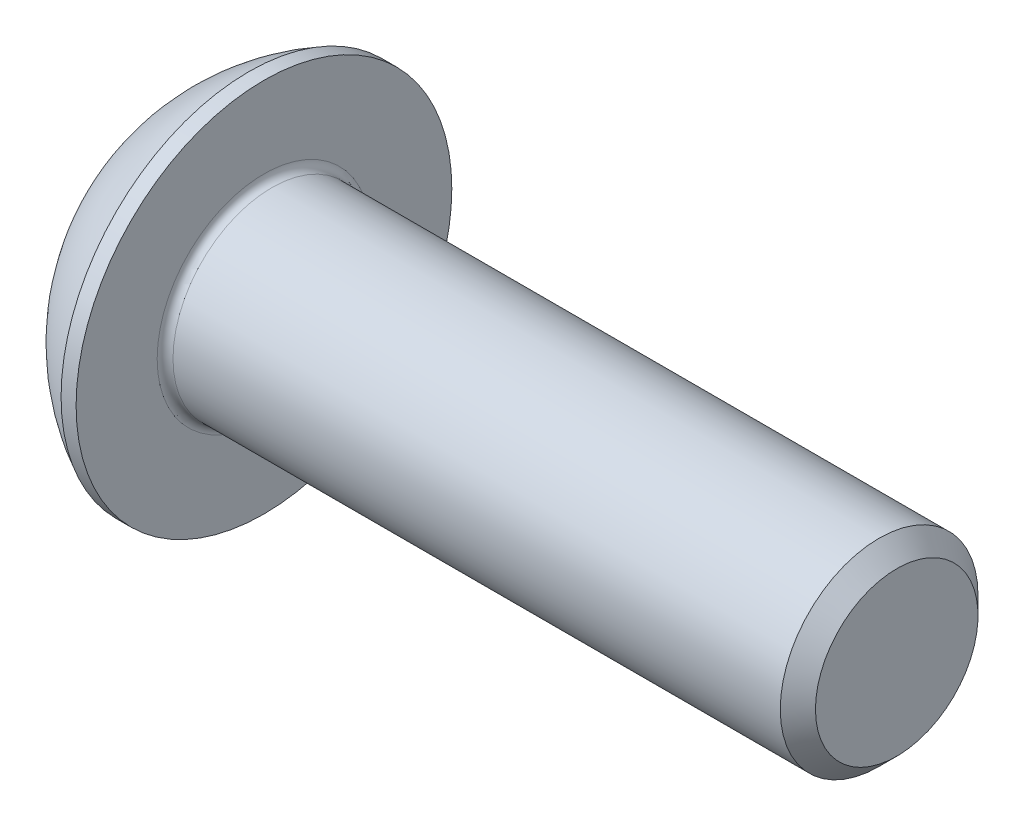
ISO-10303-21;
HEADER;
FILE_DESCRIPTION(('STEP AP214'),'2;1');
FILE_NAME('part.step','',(''),(''),'','','');
FILE_SCHEMA(('AUTOMOTIVE_DESIGN { 1 0 10303 214 1 1 1 1 }'));
ENDSEC;
DATA;
#1=APPLICATION_CONTEXT('core data for automotive mechanical design processes');
#2=APPLICATION_PROTOCOL_DEFINITION('international standard','automotive_design',2000,#1);
#3=PRODUCT_CONTEXT('',#1,'mechanical');
#4=PRODUCT('Part','Part','',(#3));
#5=PRODUCT_RELATED_PRODUCT_CATEGORY('part','',(#4));
#6=PRODUCT_DEFINITION_FORMATION('','',#4);
#7=PRODUCT_DEFINITION_CONTEXT('part definition',#1,'design');
#8=PRODUCT_DEFINITION('design','',#6,#7);
#9=PRODUCT_DEFINITION_SHAPE('','',#8);
#10=(LENGTH_UNIT() NAMED_UNIT(*) SI_UNIT(.MILLI.,.METRE.));
#11=(NAMED_UNIT(*) PLANE_ANGLE_UNIT() SI_UNIT($,.RADIAN.));
#12=(NAMED_UNIT(*) SI_UNIT($,.STERADIAN.) SOLID_ANGLE_UNIT());
#13=UNCERTAINTY_MEASURE_WITH_UNIT(LENGTH_MEASURE(1.E-05),#10,'distance_accuracy_value','');
#14=(GEOMETRIC_REPRESENTATION_CONTEXT(3) GLOBAL_UNCERTAINTY_ASSIGNED_CONTEXT((#13)) GLOBAL_UNIT_ASSIGNED_CONTEXT((#10,
#11,#12)) REPRESENTATION_CONTEXT('',''));
#15=CARTESIAN_POINT('',(0.,0.,0.));
#16=DIRECTION('',(0.,0.,1.));
#17=DIRECTION('',(1.,0.,0.));
#18=AXIS2_PLACEMENT_3D('',#15,#16,#17);
#19=CARTESIAN_POINT('',(0.,0.,0.));
#20=DIRECTION('',(-1.,0.,0.));
#21=DIRECTION('',(0.,0.,1.));
#22=AXIS2_PLACEMENT_3D('',#19,#20,#21);
#23=PLANE('',#22);
#24=CARTESIAN_POINT('',(0.,0.,0.));
#25=DIRECTION('',(-1.,0.,0.));
#26=DIRECTION('',(0.,0.,1.));
#27=AXIS2_PLACEMENT_3D('',#24,#25,#26);
#28=CIRCLE('',#27,2.375);
#29=CARTESIAN_POINT('',(0.,0.,2.375));
#30=VERTEX_POINT('',#29);
#31=EDGE_CURVE('E155',#30,#30,#28,.T.);
#32=ORIENTED_EDGE('',*,*,#31,.T.);
#33=EDGE_LOOP('',(#32));
#34=FACE_BOUND('',#33,.T.);
#35=DIRECTION('',(0.,-1.,0.));
#36=VECTOR('',#35,1.);
#37=CARTESIAN_POINT('',(0.,-0.866025403784439,1.5));
#38=LINE('',#37,#36);
#39=CARTESIAN_POINT('',(0.,0.86602540378444,1.5));
#40=VERTEX_POINT('',#39);
#41=CARTESIAN_POINT('',(0.,-0.866025403784439,1.5));
#42=VERTEX_POINT('',#41);
#43=EDGE_CURVE('E50',#40,#42,#38,.T.);
#44=ORIENTED_EDGE('',*,*,#43,.T.);
#45=DIRECTION('',(0.,-0.5,-0.866025403784439));
#46=VECTOR('',#45,1.);
#47=CARTESIAN_POINT('',(0.,-1.73205080756888,0.));
#48=LINE('',#47,#46);
#49=CARTESIAN_POINT('',(0.,-1.73205080756888,0.));
#50=VERTEX_POINT('',#49);
#51=EDGE_CURVE('E275',#42,#50,#48,.T.);
#52=ORIENTED_EDGE('',*,*,#51,.T.);
#53=DIRECTION('',(0.,0.5,-0.866025403784439));
#54=VECTOR('',#53,1.);
#55=CARTESIAN_POINT('',(0.,-0.866025403784438,-1.5));
#56=LINE('',#55,#54);
#57=CARTESIAN_POINT('',(0.,-0.866025403784438,-1.5));
#58=VERTEX_POINT('',#57);
#59=EDGE_CURVE('E130',#50,#58,#56,.T.);
#60=ORIENTED_EDGE('',*,*,#59,.T.);
#61=DIRECTION('',(0.,1.,0.));
#62=VECTOR('',#61,1.);
#63=CARTESIAN_POINT('',(0.,0.86602540378444,-1.5));
#64=LINE('',#63,#62);
#65=CARTESIAN_POINT('',(0.,0.86602540378444,-1.5));
#66=VERTEX_POINT('',#65);
#67=EDGE_CURVE('E278',#58,#66,#64,.T.);
#68=ORIENTED_EDGE('',*,*,#67,.T.);
#69=DIRECTION('',(0.,0.5,0.866025403784439));
#70=VECTOR('',#69,1.);
#71=CARTESIAN_POINT('',(0.,1.73205080756888,0.));
#72=LINE('',#71,#70);
#73=CARTESIAN_POINT('',(0.,1.73205080756888,0.));
#74=VERTEX_POINT('',#73);
#75=EDGE_CURVE('E280',#66,#74,#72,.T.);
#76=ORIENTED_EDGE('',*,*,#75,.T.);
#77=DIRECTION('',(0.,-0.5,0.866025403784439));
#78=VECTOR('',#77,1.);
#79=CARTESIAN_POINT('',(0.,0.86602540378444,1.5));
#80=LINE('',#79,#78);
#81=EDGE_CURVE('E282',#74,#40,#80,.T.);
#82=ORIENTED_EDGE('',*,*,#81,.T.);
#83=EDGE_LOOP('',(#44,#52,#60,#68,#76,#82));
#84=FACE_BOUND('',#83,.T.);
#85=ADVANCED_FACE('F35',(#34,#84),#23,.T.);
#86=CARTESIAN_POINT('',(4.75501582278481,0.,0.));
#87=DIRECTION('',(-1.,0.,0.));
#88=DIRECTION('',(0.,1.,0.));
#89=AXIS2_PLACEMENT_3D('',#86,#87,#88);
#90=SPHERICAL_SURFACE('',#89,5.3151482081814);
#91=CARTESIAN_POINT('',(2.37,0.,0.));
#92=DIRECTION('',(-1.,0.,0.));
#93=DIRECTION('',(0.,0.,1.));
#94=AXIS2_PLACEMENT_3D('',#91,#92,#93);
#95=CIRCLE('',#94,4.75);
#96=CARTESIAN_POINT('',(2.37,0.,4.75));
#97=VERTEX_POINT('',#96);
#98=EDGE_CURVE('E152',#97,#97,#95,.T.);
#99=ORIENTED_EDGE('',*,*,#98,.T.);
#100=EDGE_LOOP('',(#99));
#101=FACE_BOUND('',#100,.T.);
#102=ORIENTED_EDGE('',*,*,#31,.F.);
#103=EDGE_LOOP('',(#102));
#104=FACE_BOUND('',#103,.T.);
#105=ADVANCED_FACE('F176',(#101,#104),#90,.T.);
#106=CARTESIAN_POINT('',(0.,0.,0.));
#107=DIRECTION('',(-1.,0.,0.));
#108=DIRECTION('',(0.,0.,1.));
#109=AXIS2_PLACEMENT_3D('',#106,#107,#108);
#110=CYLINDRICAL_SURFACE('',#109,4.75);
#111=ORIENTED_EDGE('',*,*,#98,.F.);
#112=EDGE_LOOP('',(#111));
#113=FACE_BOUND('',#112,.T.);
#114=CARTESIAN_POINT('',(2.75,0.,0.));
#115=DIRECTION('',(-1.,0.,0.));
#116=DIRECTION('',(0.,0.,1.));
#117=AXIS2_PLACEMENT_3D('',#114,#115,#116);
#118=CIRCLE('',#117,4.75);
#119=CARTESIAN_POINT('',(2.75,0.,4.75));
#120=VERTEX_POINT('',#119);
#121=EDGE_CURVE('E149',#120,#120,#118,.T.);
#122=ORIENTED_EDGE('',*,*,#121,.T.);
#123=EDGE_LOOP('',(#122));
#124=FACE_BOUND('',#123,.T.);
#125=ADVANCED_FACE('F181',(#113,#124),#110,.T.);
#126=CARTESIAN_POINT('',(2.75,2.5,0.));
#127=DIRECTION('',(-1.,0.,0.));
#128=DIRECTION('',(0.,0.,1.));
#129=AXIS2_PLACEMENT_3D('',#126,#127,#128);
#130=PLANE('',#129);
#131=CARTESIAN_POINT('',(2.75,0.,0.));
#132=DIRECTION('',(-1.,0.,0.));
#133=DIRECTION('',(0.,0.,1.));
#134=AXIS2_PLACEMENT_3D('',#131,#132,#133);
#135=CIRCLE('',#134,2.7);
#136=CARTESIAN_POINT('',(2.75,0.,2.7));
#137=VERTEX_POINT('',#136);
#138=EDGE_CURVE('E43',#137,#137,#135,.T.);
#139=ORIENTED_EDGE('',*,*,#138,.T.);
#140=EDGE_LOOP('',(#139));
#141=FACE_BOUND('',#140,.T.);
#142=ORIENTED_EDGE('',*,*,#121,.F.);
#143=EDGE_LOOP('',(#142));
#144=FACE_BOUND('',#143,.T.);
#145=ADVANCED_FACE('F160',(#141,#144),#130,.F.);
#146=CARTESIAN_POINT('',(0.,0.,0.));
#147=DIRECTION('',(-1.,0.,0.));
#148=DIRECTION('',(0.,0.,1.));
#149=AXIS2_PLACEMENT_3D('',#146,#147,#148);
#150=CYLINDRICAL_SURFACE('',#149,2.5);
#151=CARTESIAN_POINT('',(2.95,0.,0.));
#152=DIRECTION('',(-1.,0.,0.));
#153=DIRECTION('',(0.,0.,1.));
#154=AXIS2_PLACEMENT_3D('',#151,#152,#153);
#155=CIRCLE('',#154,2.5);
#156=CARTESIAN_POINT('',(2.95,0.,2.5));
#157=VERTEX_POINT('',#156);
#158=EDGE_CURVE('E11',#157,#157,#155,.F.);
#159=ORIENTED_EDGE('',*,*,#158,.T.);
#160=EDGE_LOOP('',(#159));
#161=FACE_BOUND('',#160,.T.);
#162=CARTESIAN_POINT('',(18.305,0.,0.));
#163=DIRECTION('',(-1.,0.,0.));
#164=DIRECTION('',(0.,0.,1.));
#165=AXIS2_PLACEMENT_3D('',#162,#163,#164);
#166=CIRCLE('',#165,2.5);
#167=CARTESIAN_POINT('',(18.305,0.,2.5));
#168=VERTEX_POINT('',#167);
#169=EDGE_CURVE('E146',#168,#168,#166,.T.);
#170=ORIENTED_EDGE('',*,*,#169,.T.);
#171=EDGE_LOOP('',(#170));
#172=FACE_BOUND('',#171,.T.);
#173=ADVANCED_FACE('F190',(#161,#172),#150,.T.);
#174=CARTESIAN_POINT('',(18.75,0.,0.));
#175=DIRECTION('',(-1.,0.,0.));
#176=DIRECTION('',(0.,0.,1.));
#177=AXIS2_PLACEMENT_3D('',#174,#175,#176);
#178=CONICAL_SURFACE('',#177,2.055,0.785398163397444);
#179=ORIENTED_EDGE('',*,*,#169,.F.);
#180=EDGE_LOOP('',(#179));
#181=FACE_BOUND('',#180,.T.);
#182=CARTESIAN_POINT('',(18.75,0.,0.));
#183=DIRECTION('',(-1.,0.,0.));
#184=DIRECTION('',(0.,0.,1.));
#185=AXIS2_PLACEMENT_3D('',#182,#183,#184);
#186=CIRCLE('',#185,2.055);
#187=CARTESIAN_POINT('',(18.75,0.,2.055));
#188=VERTEX_POINT('',#187);
#189=EDGE_CURVE('E142',#188,#188,#186,.T.);
#190=ORIENTED_EDGE('',*,*,#189,.T.);
#191=EDGE_LOOP('',(#190));
#192=FACE_BOUND('',#191,.T.);
#193=ADVANCED_FACE('F171',(#181,#192),#178,.T.);
#194=CARTESIAN_POINT('',(18.75,0.,0.));
#195=DIRECTION('',(-1.,0.,0.));
#196=DIRECTION('',(0.,0.,1.));
#197=AXIS2_PLACEMENT_3D('',#194,#195,#196);
#198=PLANE('',#197);
#199=ORIENTED_EDGE('',*,*,#189,.F.);
#200=EDGE_LOOP('',(#199));
#201=FACE_BOUND('',#200,.T.);
#202=ADVANCED_FACE('F164',(#201),#198,.F.);
#203=CARTESIAN_POINT('',(2.95,0.,0.));
#204=DIRECTION('',(-1.,0.,0.));
#205=DIRECTION('',(0.,0.,1.));
#206=AXIS2_PLACEMENT_3D('',#203,#204,#205);
#207=TOROIDAL_SURFACE('',#206,2.7,0.2);
#208=ORIENTED_EDGE('',*,*,#158,.F.);
#209=EDGE_LOOP('',(#208));
#210=FACE_BOUND('',#209,.T.);
#211=ORIENTED_EDGE('',*,*,#138,.F.);
#212=EDGE_LOOP('',(#211));
#213=FACE_BOUND('',#212,.T.);
#214=ADVANCED_FACE('F37',(#210,#213),#207,.F.);
#215=CARTESIAN_POINT('',(1.56,-1.73205080756888,0.));
#216=DIRECTION('',(0.,0.866025403784439,-0.5));
#217=DIRECTION('',(0.,0.5,0.866025403784439));
#218=AXIS2_PLACEMENT_3D('',#215,#216,#217);
#219=PLANE('',#218);
#220=DIRECTION('',(0.,-0.5,-0.866025403784439));
#221=VECTOR('',#220,1.);
#222=CARTESIAN_POINT('',(1.56,-1.73205080756888,0.));
#223=LINE('',#222,#221);
#224=CARTESIAN_POINT('',(1.56,-0.866025403784439,1.5));
#225=VERTEX_POINT('',#224);
#226=CARTESIAN_POINT('',(1.56,-1.29903810567666,0.749999999999999));
#227=VERTEX_POINT('',#226);
#228=EDGE_CURVE('E116',#225,#227,#223,.T.);
#229=ORIENTED_EDGE('',*,*,#228,.T.);
#230=CARTESIAN_POINT('',(1.56,-1.73205080756888,0.));
#231=VERTEX_POINT('',#230);
#232=EDGE_CURVE('E111',#227,#231,#223,.T.);
#233=ORIENTED_EDGE('',*,*,#232,.T.);
#234=DIRECTION('',(-1.,0.,0.));
#235=VECTOR('',#234,1.);
#236=CARTESIAN_POINT('',(1.56,-1.73205080756888,0.));
#237=LINE('',#236,#235);
#238=EDGE_CURVE('E113',#231,#50,#237,.T.);
#239=ORIENTED_EDGE('',*,*,#238,.T.);
#240=ORIENTED_EDGE('',*,*,#51,.F.);
#241=DIRECTION('',(-1.,0.,0.));
#242=VECTOR('',#241,1.);
#243=CARTESIAN_POINT('',(1.56,-0.866025403784439,1.5));
#244=LINE('',#243,#242);
#245=EDGE_CURVE('E271',#225,#42,#244,.T.);
#246=ORIENTED_EDGE('',*,*,#245,.F.);
#247=EDGE_LOOP('',(#229,#233,#239,#240,#246));
#248=FACE_BOUND('',#247,.T.);
#249=ADVANCED_FACE('F112',(#248),#219,.T.);
#250=CARTESIAN_POINT('',(1.56,-0.866025403784438,-1.5));
#251=DIRECTION('',(0.,0.866025403784439,0.5));
#252=DIRECTION('',(0.,-0.5,0.866025403784439));
#253=AXIS2_PLACEMENT_3D('',#250,#251,#252);
#254=PLANE('',#253);
#255=DIRECTION('',(0.,0.5,-0.866025403784439));
#256=VECTOR('',#255,1.);
#257=CARTESIAN_POINT('',(1.56,-0.866025403784438,-1.5));
#258=LINE('',#257,#256);
#259=CARTESIAN_POINT('',(1.56,-1.29903810567666,-0.75));
#260=VERTEX_POINT('',#259);
#261=EDGE_CURVE('E58',#231,#260,#258,.T.);
#262=ORIENTED_EDGE('',*,*,#261,.T.);
#263=CARTESIAN_POINT('',(1.56,-0.866025403784438,-1.5));
#264=VERTEX_POINT('',#263);
#265=EDGE_CURVE('E125',#260,#264,#258,.T.);
#266=ORIENTED_EDGE('',*,*,#265,.T.);
#267=DIRECTION('',(-1.,0.,0.));
#268=VECTOR('',#267,1.);
#269=CARTESIAN_POINT('',(1.56,-0.866025403784438,-1.5));
#270=LINE('',#269,#268);
#271=EDGE_CURVE('E132',#264,#58,#270,.T.);
#272=ORIENTED_EDGE('',*,*,#271,.T.);
#273=ORIENTED_EDGE('',*,*,#59,.F.);
#274=ORIENTED_EDGE('',*,*,#238,.F.);
#275=EDGE_LOOP('',(#262,#266,#272,#273,#274));
#276=FACE_BOUND('',#275,.T.);
#277=ADVANCED_FACE('F128',(#276),#254,.T.);
#278=CARTESIAN_POINT('',(1.56,0.86602540378444,-1.5));
#279=DIRECTION('',(0.,0.,1.));
#280=DIRECTION('',(1.,0.,0.));
#281=AXIS2_PLACEMENT_3D('',#278,#279,#280);
#282=PLANE('',#281);
#283=DIRECTION('',(0.,1.,0.));
#284=VECTOR('',#283,1.);
#285=CARTESIAN_POINT('',(1.56,0.86602540378444,-1.5));
#286=LINE('',#285,#284);
#287=CARTESIAN_POINT('',(1.56,0.,-1.5));
#288=VERTEX_POINT('',#287);
#289=EDGE_CURVE('E252',#264,#288,#286,.T.);
#290=ORIENTED_EDGE('',*,*,#289,.T.);
#291=CARTESIAN_POINT('',(1.56,0.86602540378444,-1.5));
#292=VERTEX_POINT('',#291);
#293=EDGE_CURVE('E124',#288,#292,#286,.T.);
#294=ORIENTED_EDGE('',*,*,#293,.T.);
#295=DIRECTION('',(-1.,0.,0.));
#296=VECTOR('',#295,1.);
#297=CARTESIAN_POINT('',(1.56,0.86602540378444,-1.5));
#298=LINE('',#297,#296);
#299=EDGE_CURVE('E137',#292,#66,#298,.T.);
#300=ORIENTED_EDGE('',*,*,#299,.T.);
#301=ORIENTED_EDGE('',*,*,#67,.F.);
#302=ORIENTED_EDGE('',*,*,#271,.F.);
#303=EDGE_LOOP('',(#290,#294,#300,#301,#302));
#304=FACE_BOUND('',#303,.T.);
#305=ADVANCED_FACE('F204',(#304),#282,.T.);
#306=CARTESIAN_POINT('',(1.56,1.73205080756888,0.));
#307=DIRECTION('',(0.,-0.866025403784439,0.5));
#308=DIRECTION('',(0.,-0.5,-0.866025403784439));
#309=AXIS2_PLACEMENT_3D('',#306,#307,#308);
#310=PLANE('',#309);
#311=DIRECTION('',(0.,0.5,0.866025403784439));
#312=VECTOR('',#311,1.);
#313=CARTESIAN_POINT('',(1.56,1.73205080756888,0.));
#314=LINE('',#313,#312);
#315=CARTESIAN_POINT('',(1.56,1.29903810567666,-0.75));
#316=VERTEX_POINT('',#315);
#317=EDGE_CURVE('E241',#292,#316,#314,.T.);
#318=ORIENTED_EDGE('',*,*,#317,.T.);
#319=CARTESIAN_POINT('',(1.56,1.73205080756888,0.));
#320=VERTEX_POINT('',#319);
#321=EDGE_CURVE('E246',#316,#320,#314,.T.);
#322=ORIENTED_EDGE('',*,*,#321,.T.);
#323=DIRECTION('',(-1.,0.,0.));
#324=VECTOR('',#323,1.);
#325=CARTESIAN_POINT('',(1.56,1.73205080756888,0.));
#326=LINE('',#325,#324);
#327=EDGE_CURVE('E286',#320,#74,#326,.T.);
#328=ORIENTED_EDGE('',*,*,#327,.T.);
#329=ORIENTED_EDGE('',*,*,#75,.F.);
#330=ORIENTED_EDGE('',*,*,#299,.F.);
#331=EDGE_LOOP('',(#318,#322,#328,#329,#330));
#332=FACE_BOUND('',#331,.T.);
#333=ADVANCED_FACE('F207',(#332),#310,.T.);
#334=CARTESIAN_POINT('',(1.56,0.86602540378444,1.5));
#335=DIRECTION('',(0.,-0.866025403784439,-0.5));
#336=DIRECTION('',(0.,0.5,-0.866025403784439));
#337=AXIS2_PLACEMENT_3D('',#334,#335,#336);
#338=PLANE('',#337);
#339=DIRECTION('',(0.,-0.5,0.866025403784439));
#340=VECTOR('',#339,1.);
#341=CARTESIAN_POINT('',(1.56,0.86602540378444,1.5));
#342=LINE('',#341,#340);
#343=CARTESIAN_POINT('',(1.56,1.29903810567666,0.75));
#344=VERTEX_POINT('',#343);
#345=EDGE_CURVE('E249',#320,#344,#342,.T.);
#346=ORIENTED_EDGE('',*,*,#345,.T.);
#347=CARTESIAN_POINT('',(1.56,0.86602540378444,1.5));
#348=VERTEX_POINT('',#347);
#349=EDGE_CURVE('E257',#344,#348,#342,.T.);
#350=ORIENTED_EDGE('',*,*,#349,.T.);
#351=DIRECTION('',(-1.,0.,0.));
#352=VECTOR('',#351,1.);
#353=CARTESIAN_POINT('',(1.56,0.86602540378444,1.5));
#354=LINE('',#353,#352);
#355=EDGE_CURVE('E270',#348,#40,#354,.T.);
#356=ORIENTED_EDGE('',*,*,#355,.T.);
#357=ORIENTED_EDGE('',*,*,#81,.F.);
#358=ORIENTED_EDGE('',*,*,#327,.F.);
#359=EDGE_LOOP('',(#346,#350,#356,#357,#358));
#360=FACE_BOUND('',#359,.T.);
#361=ADVANCED_FACE('F211',(#360),#338,.T.);
#362=CARTESIAN_POINT('',(1.56,-0.866025403784439,1.5));
#363=DIRECTION('',(0.,0.,-1.));
#364=DIRECTION('',(0.,1.,0.));
#365=AXIS2_PLACEMENT_3D('',#362,#363,#364);
#366=PLANE('',#365);
#367=DIRECTION('',(0.,-1.,0.));
#368=VECTOR('',#367,1.);
#369=CARTESIAN_POINT('',(1.56,-0.866025403784439,1.5));
#370=LINE('',#369,#368);
#371=CARTESIAN_POINT('',(1.56,0.,1.5));
#372=VERTEX_POINT('',#371);
#373=EDGE_CURVE('E263',#348,#372,#370,.T.);
#374=ORIENTED_EDGE('',*,*,#373,.T.);
#375=EDGE_CURVE('E265',#372,#225,#370,.T.);
#376=ORIENTED_EDGE('',*,*,#375,.T.);
#377=ORIENTED_EDGE('',*,*,#245,.T.);
#378=ORIENTED_EDGE('',*,*,#43,.F.);
#379=ORIENTED_EDGE('',*,*,#355,.F.);
#380=EDGE_LOOP('',(#374,#376,#377,#378,#379));
#381=FACE_BOUND('',#380,.T.);
#382=ADVANCED_FACE('F215',(#381),#366,.T.);
#383=CARTESIAN_POINT('',(1.56,-2.59807621135332,-1.5));
#384=DIRECTION('',(1.,0.,0.));
#385=DIRECTION('',(0.,0.,-1.));
#386=AXIS2_PLACEMENT_3D('',#383,#384,#385);
#387=PLANE('',#386);
#388=CARTESIAN_POINT('',(1.56,0.,0.));
#389=DIRECTION('',(-1.,0.,0.));
#390=DIRECTION('',(0.,0.,1.));
#391=AXIS2_PLACEMENT_3D('',#388,#389,#390);
#392=CIRCLE('',#391,1.5);
#393=EDGE_CURVE('E238',#316,#288,#392,.T.);
#394=ORIENTED_EDGE('',*,*,#393,.F.);
#395=ORIENTED_EDGE('',*,*,#317,.F.);
#396=ORIENTED_EDGE('',*,*,#293,.F.);
#397=EDGE_LOOP('',(#394,#395,#396));
#398=FACE_BOUND('',#397,.T.);
#399=ADVANCED_FACE('F219',(#398),#387,.F.);
#400=EDGE_CURVE('E143',#344,#316,#392,.T.);
#401=ORIENTED_EDGE('',*,*,#400,.F.);
#402=ORIENTED_EDGE('',*,*,#345,.F.);
#403=ORIENTED_EDGE('',*,*,#321,.F.);
#404=EDGE_LOOP('',(#401,#402,#403));
#405=FACE_BOUND('',#404,.T.);
#406=ADVANCED_FACE('F228',(#405),#387,.F.);
#407=EDGE_CURVE('E136',#372,#344,#392,.T.);
#408=ORIENTED_EDGE('',*,*,#407,.F.);
#409=ORIENTED_EDGE('',*,*,#373,.F.);
#410=ORIENTED_EDGE('',*,*,#349,.F.);
#411=EDGE_LOOP('',(#408,#409,#410));
#412=FACE_BOUND('',#411,.T.);
#413=ADVANCED_FACE('F233',(#412),#387,.F.);
#414=EDGE_CURVE('E131',#227,#372,#392,.T.);
#415=ORIENTED_EDGE('',*,*,#414,.F.);
#416=ORIENTED_EDGE('',*,*,#228,.F.);
#417=ORIENTED_EDGE('',*,*,#375,.F.);
#418=EDGE_LOOP('',(#415,#416,#417));
#419=FACE_BOUND('',#418,.T.);
#420=ADVANCED_FACE('F226',(#419),#387,.F.);
#421=EDGE_CURVE('E122',#260,#227,#392,.T.);
#422=ORIENTED_EDGE('',*,*,#421,.F.);
#423=ORIENTED_EDGE('',*,*,#261,.F.);
#424=ORIENTED_EDGE('',*,*,#232,.F.);
#425=EDGE_LOOP('',(#422,#423,#424));
#426=FACE_BOUND('',#425,.T.);
#427=ADVANCED_FACE('F121',(#426),#387,.F.);
#428=EDGE_CURVE('E244',#288,#260,#392,.T.);
#429=ORIENTED_EDGE('',*,*,#428,.F.);
#430=ORIENTED_EDGE('',*,*,#289,.F.);
#431=ORIENTED_EDGE('',*,*,#265,.F.);
#432=EDGE_LOOP('',(#429,#430,#431));
#433=FACE_BOUND('',#432,.T.);
#434=ADVANCED_FACE('F199',(#433),#387,.F.);
#435=CARTESIAN_POINT('',(2.42602540378445,0.,0.));
#436=DIRECTION('',(-1.,0.,0.));
#437=DIRECTION('',(0.,0.,1.));
#438=AXIS2_PLACEMENT_3D('',#435,#436,#437);
#439=CONICAL_SURFACE('',#438,0.,1.04719755119659);
#440=ORIENTED_EDGE('',*,*,#407,.T.);
#441=ORIENTED_EDGE('',*,*,#400,.T.);
#442=ORIENTED_EDGE('',*,*,#393,.T.);
#443=ORIENTED_EDGE('',*,*,#428,.T.);
#444=ORIENTED_EDGE('',*,*,#421,.T.);
#445=ORIENTED_EDGE('',*,*,#414,.T.);
#446=EDGE_LOOP('',(#440,#441,#442,#443,#444,#445));
#447=FACE_BOUND('',#446,.T.);
#448=CARTESIAN_POINT('',(2.42602540378445,0.,0.));
#449=VERTEX_POINT('',#448);
#450=VERTEX_LOOP('',#449);
#451=FACE_BOUND('',#450,.T.);
#452=ADVANCED_FACE('F197',(#447,#451),#439,.F.);
#453=CLOSED_SHELL('',(#85,#105,#125,#145,#173,#193,#202,#214,#249,#277,#305,#333,#361,#382,#399,
#406,#413,#420,#427,#434,#452));
#454=MANIFOLD_SOLID_BREP('B2',#453);
#455=ADVANCED_BREP_SHAPE_REPRESENTATION('',(#18,#454),#14);
#456=SHAPE_DEFINITION_REPRESENTATION(#9,#455);
ENDSEC;
END-ISO-10303-21;
